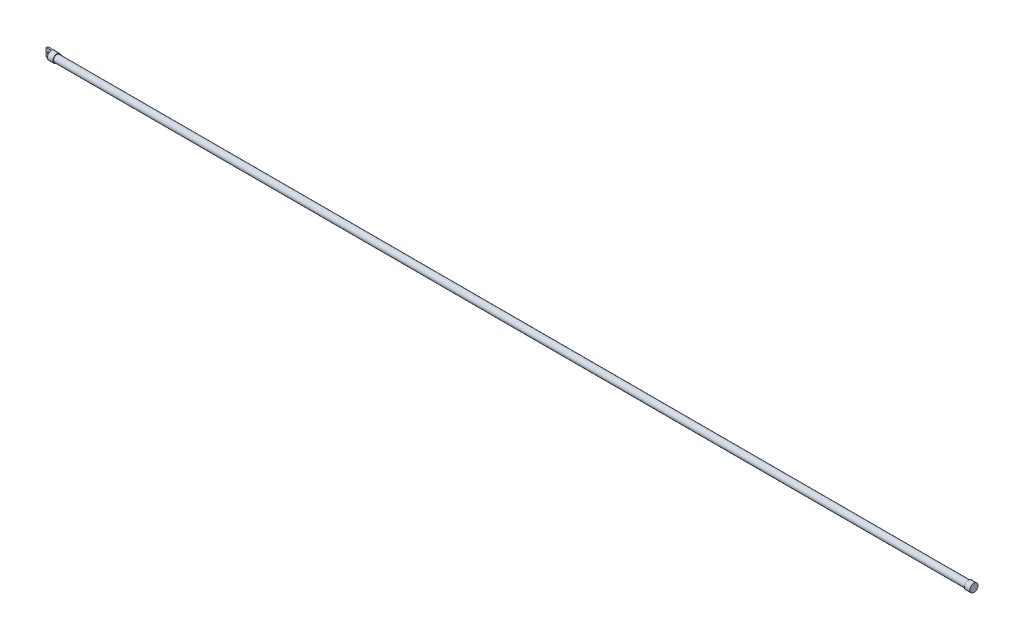
ISO-10303-21;
HEADER;
FILE_DESCRIPTION(('STEP AP214'),'2;1');
FILE_NAME('part.step','',(''),(''),'','','');
FILE_SCHEMA(('AUTOMOTIVE_DESIGN { 1 0 10303 214 1 1 1 1 }'));
ENDSEC;
DATA;
#1=APPLICATION_CONTEXT('core data for automotive mechanical design processes');
#2=APPLICATION_PROTOCOL_DEFINITION('international standard','automotive_design',2000,#1);
#3=PRODUCT_CONTEXT('',#1,'mechanical');
#4=PRODUCT('Part','Part','',(#3));
#5=PRODUCT_RELATED_PRODUCT_CATEGORY('part','',(#4));
#6=PRODUCT_DEFINITION_FORMATION('','',#4);
#7=PRODUCT_DEFINITION_CONTEXT('part definition',#1,'design');
#8=PRODUCT_DEFINITION('design','',#6,#7);
#9=PRODUCT_DEFINITION_SHAPE('','',#8);
#10=(LENGTH_UNIT() NAMED_UNIT(*) SI_UNIT(.MILLI.,.METRE.));
#11=(NAMED_UNIT(*) PLANE_ANGLE_UNIT() SI_UNIT($,.RADIAN.));
#12=(NAMED_UNIT(*) SI_UNIT($,.STERADIAN.) SOLID_ANGLE_UNIT());
#13=UNCERTAINTY_MEASURE_WITH_UNIT(LENGTH_MEASURE(1.E-05),#10,'distance_accuracy_value','');
#14=(GEOMETRIC_REPRESENTATION_CONTEXT(3) GLOBAL_UNCERTAINTY_ASSIGNED_CONTEXT((#13)) GLOBAL_UNIT_ASSIGNED_CONTEXT((#10,
#11,#12)) REPRESENTATION_CONTEXT('',''));
#15=CARTESIAN_POINT('',(0.,0.,0.));
#16=DIRECTION('',(0.,0.,1.));
#17=DIRECTION('',(1.,0.,0.));
#18=AXIS2_PLACEMENT_3D('',#15,#16,#17);
#19=CARTESIAN_POINT('',(4267.2,0.,0.));
#20=DIRECTION('',(-1.,0.,0.));
#21=DIRECTION('',(0.,0.,1.));
#22=AXIS2_PLACEMENT_3D('',#19,#20,#21);
#23=CYLINDRICAL_SURFACE('',#22,15.875);
#24=CARTESIAN_POINT('',(0.,0.,0.));
#25=DIRECTION('',(-1.,0.,0.));
#26=DIRECTION('',(0.,0.,1.));
#27=AXIS2_PLACEMENT_3D('',#24,#25,#26);
#28=CIRCLE('',#27,15.875);
#29=CARTESIAN_POINT('',(0.,0.,15.875));
#30=VERTEX_POINT('',#29);
#31=EDGE_CURVE('E69',#30,#30,#28,.T.);
#32=ORIENTED_EDGE('',*,*,#31,.F.);
#33=EDGE_LOOP('',(#32));
#34=FACE_BOUND('',#33,.T.);
#35=CARTESIAN_POINT('',(4241.8,0.,0.));
#36=DIRECTION('',(1.,0.,0.));
#37=DIRECTION('',(0.,0.,-1.));
#38=AXIS2_PLACEMENT_3D('',#35,#36,#37);
#39=CIRCLE('',#38,15.875);
#40=CARTESIAN_POINT('',(4241.8,0.,-15.875));
#41=VERTEX_POINT('',#40);
#42=EDGE_CURVE('E60',#41,#41,#39,.T.);
#43=ORIENTED_EDGE('',*,*,#42,.F.);
#44=EDGE_LOOP('',(#43));
#45=FACE_BOUND('',#44,.T.);
#46=ADVANCED_FACE('F32',(#34,#45),#23,.T.);
#47=CARTESIAN_POINT('',(4241.8,0.,0.));
#48=DIRECTION('',(1.,0.,0.));
#49=DIRECTION('',(0.,0.,-1.));
#50=AXIS2_PLACEMENT_3D('',#47,#48,#49);
#51=PLANE('',#50);
#52=CARTESIAN_POINT('',(4241.8,0.,0.));
#53=DIRECTION('',(1.,0.,0.));
#54=DIRECTION('',(0.,0.,-1.));
#55=AXIS2_PLACEMENT_3D('',#52,#53,#54);
#56=CIRCLE('',#55,19.05);
#57=CARTESIAN_POINT('',(4241.8,0.,-19.05));
#58=VERTEX_POINT('',#57);
#59=EDGE_CURVE('E79',#58,#58,#56,.T.);
#60=ORIENTED_EDGE('',*,*,#59,.F.);
#61=EDGE_LOOP('',(#60));
#62=FACE_BOUND('',#61,.T.);
#63=ORIENTED_EDGE('',*,*,#42,.T.);
#64=EDGE_LOOP('',(#63));
#65=FACE_BOUND('',#64,.T.);
#66=ADVANCED_FACE('F87',(#62,#65),#51,.F.);
#67=CARTESIAN_POINT('',(4241.8,0.,0.));
#68=DIRECTION('',(1.,0.,0.));
#69=DIRECTION('',(0.,0.,-1.));
#70=AXIS2_PLACEMENT_3D('',#67,#68,#69);
#71=CYLINDRICAL_SURFACE('',#70,19.05);
#72=ORIENTED_EDGE('',*,*,#59,.T.);
#73=EDGE_LOOP('',(#72));
#74=FACE_BOUND('',#73,.T.);
#75=CARTESIAN_POINT('',(4267.2,0.,0.));
#76=DIRECTION('',(1.,0.,0.));
#77=DIRECTION('',(0.,0.,-1.));
#78=AXIS2_PLACEMENT_3D('',#75,#76,#77);
#79=CIRCLE('',#78,19.05);
#80=CARTESIAN_POINT('',(4267.2,0.,-19.05));
#81=VERTEX_POINT('',#80);
#82=EDGE_CURVE('E73',#81,#81,#79,.T.);
#83=ORIENTED_EDGE('',*,*,#82,.F.);
#84=EDGE_LOOP('',(#83));
#85=FACE_BOUND('',#84,.T.);
#86=ADVANCED_FACE('F94',(#74,#85),#71,.T.);
#87=CARTESIAN_POINT('',(4267.2,0.,0.));
#88=DIRECTION('',(1.,0.,0.));
#89=DIRECTION('',(0.,0.,-1.));
#90=AXIS2_PLACEMENT_3D('',#87,#88,#89);
#91=PLANE('',#90);
#92=ORIENTED_EDGE('',*,*,#82,.T.);
#93=EDGE_LOOP('',(#92));
#94=FACE_BOUND('',#93,.T.);
#95=ADVANCED_FACE('F101',(#94),#91,.T.);
#96=CARTESIAN_POINT('',(0.,0.,0.));
#97=DIRECTION('',(-1.,0.,0.));
#98=DIRECTION('',(0.,0.,1.));
#99=AXIS2_PLACEMENT_3D('',#96,#97,#98);
#100=PLANE('',#99);
#101=CARTESIAN_POINT('',(0.,0.,0.));
#102=DIRECTION('',(-1.,0.,0.));
#103=DIRECTION('',(0.,0.,1.));
#104=AXIS2_PLACEMENT_3D('',#101,#102,#103);
#105=CIRCLE('',#104,19.05);
#106=CARTESIAN_POINT('',(0.,0.,19.05));
#107=VERTEX_POINT('',#106);
#108=EDGE_CURVE('E70',#107,#107,#105,.T.);
#109=ORIENTED_EDGE('',*,*,#108,.F.);
#110=EDGE_LOOP('',(#109));
#111=FACE_BOUND('',#110,.T.);
#112=ORIENTED_EDGE('',*,*,#31,.T.);
#113=EDGE_LOOP('',(#112));
#114=FACE_BOUND('',#113,.T.);
#115=ADVANCED_FACE('F99',(#111,#114),#100,.F.);
#116=CARTESIAN_POINT('',(-50.8,0.,0.));
#117=DIRECTION('',(1.,0.,0.));
#118=DIRECTION('',(0.,0.,-1.));
#119=AXIS2_PLACEMENT_3D('',#116,#117,#118);
#120=CYLINDRICAL_SURFACE('',#119,19.05);
#121=CARTESIAN_POINT('',(-31.75,0.,-19.05));
#122=CARTESIAN_POINT('',(-31.7499999276378,0.173206979816121,-19.0500000475544));
#123=CARTESIAN_POINT('',(-31.7570924399296,0.346412900541876,-19.0476323411038));
#124=CARTESIAN_POINT('',(-31.7853988596846,0.691601311110433,-19.0382249618458));
#125=CARTESIAN_POINT('',(-31.8066178799022,0.863583335207509,-19.0311835975216));
#126=CARTESIAN_POINT('',(-31.8629724237648,1.20495064928589,-19.0126222999959));
#127=CARTESIAN_POINT('',(-31.898103808817,1.3743366959572,-19.0011036986832));
#128=CARTESIAN_POINT('',(-31.9819775593791,1.70942803420247,-18.9738932742665));
#129=CARTESIAN_POINT('',(-32.0307251826636,1.87513187719384,-18.9581998392036));
#130=CARTESIAN_POINT('',(-32.1412853073881,2.20132105058004,-18.9230954347253));
#131=CARTESIAN_POINT('',(-32.2030702890873,2.36181656426823,-18.9036923038523));
#132=CARTESIAN_POINT('',(-32.3392884277158,2.67697294486436,-18.861643657703));
#133=CARTESIAN_POINT('',(-32.4137262645729,2.8316316269366,-18.8389969432077));
#134=CARTESIAN_POINT('',(-32.5746540459558,3.13406899750511,-18.7910497757426));
#135=CARTESIAN_POINT('',(-32.6611414823733,3.28184910924858,-18.7657498753001));
#136=CARTESIAN_POINT('',(-32.8456056484711,3.56974509074054,-18.7131195970424));
#137=CARTESIAN_POINT('',(-32.9435865005668,3.70985818392422,-18.6857884919782));
#138=CARTESIAN_POINT('',(-33.1535880112745,3.98578637726499,-18.6289146881802));
#139=CARTESIAN_POINT('',(-33.2659501290115,4.12133296305893,-18.5993296703084));
#140=CARTESIAN_POINT('',(-33.501456566368,4.38255929576647,-18.5395154443744));
#141=CARTESIAN_POINT('',(-33.6246011255233,4.50823882336203,-18.5092862220122));
#142=CARTESIAN_POINT('',(-33.8809614747341,4.74901553774605,-18.4489772883087));
#143=CARTESIAN_POINT('',(-34.0141811127906,4.86410864366074,-18.4188976388164));
#144=CARTESIAN_POINT('',(-34.289801826601,5.08289666356067,-18.3597250300466));
#145=CARTESIAN_POINT('',(-34.4321997394184,5.18659547118079,-18.3306317360784));
#146=CARTESIAN_POINT('',(-34.7296564433137,5.38480736636177,-18.2734042587362));
#147=CARTESIAN_POINT('',(-34.8849636102427,5.47896348886477,-18.2453229440573));
#148=CARTESIAN_POINT('',(-35.2033789289295,5.65376497667275,-18.1919156575976));
#149=CARTESIAN_POINT('',(-35.3664839701791,5.73441567232334,-18.1665886001519));
#150=CARTESIAN_POINT('',(-35.6994807069751,5.88159402568306,-18.1194737199416));
#151=CARTESIAN_POINT('',(-35.8693735998872,5.94811917848413,-18.0976865250677));
#152=CARTESIAN_POINT('',(-36.2146276910965,6.06639515366292,-18.0583841320978));
#153=CARTESIAN_POINT('',(-36.3899863573345,6.11815270763609,-18.0408669880933));
#154=CARTESIAN_POINT('',(-36.7389979304016,6.20495158956039,-18.0111940183235));
#155=CARTESIAN_POINT('',(-36.9125131587002,6.24049221012225,-17.9988790739554));
#156=CARTESIAN_POINT('',(-37.2621130255256,6.29696610143421,-17.9791995169245));
#157=CARTESIAN_POINT('',(-37.4381965614469,6.31790546258156,-17.9718328403146));
#158=CARTESIAN_POINT('',(-37.7916266406054,6.34498350403309,-17.9622908169983));
#159=CARTESIAN_POINT('',(-37.9689730959295,6.35112320464729,-17.960115112419));
#160=CARTESIAN_POINT('',(-38.3235414467177,6.3485398247218,-17.9610285072459));
#161=CARTESIAN_POINT('',(-38.5007633455553,6.33981716356741,-17.9641174580944));
#162=CARTESIAN_POINT('',(-38.8455739071675,6.30834384063319,-17.9751928357032));
#163=CARTESIAN_POINT('',(-39.0132310497841,6.2862561392762,-17.9829477165395));
#164=CARTESIAN_POINT('',(-39.3460488561246,6.22883516245981,-18.0029174212393));
#165=CARTESIAN_POINT('',(-39.5112086602302,6.19349742948017,-18.0151337459671));
#166=CARTESIAN_POINT('',(-39.8378100844255,6.10990376478512,-18.0436560154073));
#167=CARTESIAN_POINT('',(-39.999252732489,6.06165145233205,-18.0599608142595));
#168=CARTESIAN_POINT('',(-40.3174910779539,5.95260759283797,-18.0961946727035));
#169=CARTESIAN_POINT('',(-40.4742849849099,5.89181128446951,-18.1161251081381));
#170=CARTESIAN_POINT('',(-40.7846294633379,5.75711105118028,-18.1593846683067));
#171=CARTESIAN_POINT('',(-40.938090326431,5.68301613062838,-18.182762287283));
#172=CARTESIAN_POINT('',(-41.2383034780893,5.52290717349518,-18.2320325481052));
#173=CARTESIAN_POINT('',(-41.3850534516872,5.43688906456495,-18.2579260483393));
#174=CARTESIAN_POINT('',(-41.6709619221975,5.25352969212448,-18.3115276913353));
#175=CARTESIAN_POINT('',(-41.8101198982885,5.15618765320853,-18.3392359583063));
#176=CARTESIAN_POINT('',(-42.0800614588839,4.95079561055338,-18.3957458615903));
#177=CARTESIAN_POINT('',(-42.210844746996,4.84274522817477,-18.4245475365431));
#178=CARTESIAN_POINT('',(-42.4699319136144,4.61064072542746,-18.4840358963059));
#179=CARTESIAN_POINT('',(-42.5977461912074,4.48604452199054,-18.5147422324821));
#180=CARTESIAN_POINT('',(-42.8424464337536,4.22652342644298,-18.575703434143));
#181=CARTESIAN_POINT('',(-42.9593358297475,4.09160180148376,-18.6059584388461));
#182=CARTESIAN_POINT('',(-43.1815188690624,3.81215729550636,-18.6652179866419));
#183=CARTESIAN_POINT('',(-43.2868069689114,3.66762987695637,-18.6942219279428));
#184=CARTESIAN_POINT('',(-43.4849442138419,3.36998882083473,-18.7501624717454));
#185=CARTESIAN_POINT('',(-43.5777982793778,3.21687861391426,-18.777099890208));
#186=CARTESIAN_POINT('',(-43.751311532146,2.90136608662605,-18.8284460358764));
#187=CARTESIAN_POINT('',(-43.8318341058571,2.73888379955612,-18.852825607187));
#188=CARTESIAN_POINT('',(-43.9788113974916,2.40727117302262,-18.8980298666498));
#189=CARTESIAN_POINT('',(-44.0452715681074,2.23814344060155,-18.9188559320642));
#190=CARTESIAN_POINT('',(-44.163558777101,1.89440949234185,-18.9563603220822));
#191=CARTESIAN_POINT('',(-44.2153870061177,1.71980372355069,-18.9730389841577));
#192=CARTESIAN_POINT('',(-44.3039144398891,1.36642567213485,-19.0017577647123));
#193=CARTESIAN_POINT('',(-44.3406143409563,1.18765358167399,-19.0137980966785));
#194=CARTESIAN_POINT('',(-44.3972579625842,0.835171292256401,-19.0324663756725));
#195=CARTESIAN_POINT('',(-44.4178592890451,0.661577761094121,-19.0393063851572));
#196=CARTESIAN_POINT('',(-44.4446791680636,0.313163139048648,-19.0482228098157));
#197=CARTESIAN_POINT('',(-44.4508981701628,0.138342086704824,-19.0502993738781));
#198=CARTESIAN_POINT('',(-44.4488929516177,-0.211180699577593,-19.0496310005562));
#199=CARTESIAN_POINT('',(-44.4406708901043,-0.385882447447029,-19.0468867839424));
#200=CARTESIAN_POINT('',(-44.4098684948127,-0.733873450364134,-19.0366548939182));
#201=CARTESIAN_POINT('',(-44.3872883060322,-0.907162719658031,-19.0291672684097));
#202=CARTESIAN_POINT('',(-44.3288551400234,-1.24601609779628,-19.0099421572362));
#203=CARTESIAN_POINT('',(-44.2934089964992,-1.41165802541743,-18.9983351567187));
#204=CARTESIAN_POINT('',(-44.2094878330244,-1.73933064567692,-18.9711429855808));
#205=CARTESIAN_POINT('',(-44.1610084764415,-1.90136011684896,-18.9555564909225));
#206=CARTESIAN_POINT('',(-44.0514444025778,-2.22065102237401,-18.9208084901865));
#207=CARTESIAN_POINT('',(-43.9903630676732,-2.37791372316702,-18.901647943518));
#208=CARTESIAN_POINT('',(-43.8560394008498,-2.68679846475975,-18.8602202631813));
#209=CARTESIAN_POINT('',(-43.7827924703357,-2.83841834594381,-18.8379519552898));
#210=CARTESIAN_POINT('',(-43.6226340287902,-3.13890847872106,-18.7902499584476));
#211=CARTESIAN_POINT('',(-43.5354173898331,-3.28760543041955,-18.7647491525867));
#212=CARTESIAN_POINT('',(-43.3493492766861,-3.57721512709606,-18.7116999684213));
#213=CARTESIAN_POINT('',(-43.2504937905531,-3.71812516316432,-18.6841508852828));
#214=CARTESIAN_POINT('',(-43.0418134240538,-3.99130640387261,-18.6277060092511));
#215=CARTESIAN_POINT('',(-42.9319874864589,-4.12357677386765,-18.5988100867056));
#216=CARTESIAN_POINT('',(-42.7020524492227,-4.37871059436876,-18.54040247239));
#217=CARTESIAN_POINT('',(-42.5819430804423,-4.50157379850997,-18.5108907645187));
#218=CARTESIAN_POINT('',(-42.3264380874391,-4.74256806278791,-18.4506550930792));
#219=CARTESIAN_POINT('',(-42.190594822557,-4.86022661336041,-18.4199373319635));
#220=CARTESIAN_POINT('',(-41.90933472828,-5.08367167126115,-18.3595255094858));
#221=CARTESIAN_POINT('',(-41.763921090819,-5.18946210535388,-18.3298311117932));
#222=CARTESIAN_POINT('',(-41.4643206319029,-5.388525335144,-18.2723024560637));
#223=CARTESIAN_POINT('',(-41.3101301614477,-5.48179286946921,-18.2444689823258));
#224=CARTESIAN_POINT('',(-40.9940807074354,-5.65502039443443,-18.1915213339223));
#225=CARTESIAN_POINT('',(-40.8322249540841,-5.73498592764397,-18.1664060282044));
#226=CARTESIAN_POINT('',(-40.5021210996305,-5.88088643247245,-18.119700256613));
#227=CARTESIAN_POINT('',(-40.3338834294161,-5.94684322686595,-18.0981043206734));
#228=CARTESIAN_POINT('',(-39.9920265973133,-6.0642710619397,-18.0590959794666));
#229=CARTESIAN_POINT('',(-39.8184096779651,-6.11574805121028,-18.0416818566593));
#230=CARTESIAN_POINT('',(-39.46704911889,-6.20374641951342,-18.0116128053345));
#231=CARTESIAN_POINT('',(-39.2893061866693,-6.24027034288944,-17.9989570671825));
#232=CARTESIAN_POINT('',(-38.9310610986803,-6.29799572673677,-17.9788400300668));
#233=CARTESIAN_POINT('',(-38.7505590824325,-6.31919795939107,-17.9713784693274));
#234=CARTESIAN_POINT('',(-38.397614645785,-6.34536101450615,-17.9621566611392));
#235=CARTESIAN_POINT('',(-38.2252368738401,-6.35110334330266,-17.9601221272408));
#236=CARTESIAN_POINT('',(-37.8805373563697,-6.3485471048946,-17.9610259404646));
#237=CARTESIAN_POINT('',(-37.708215649795,-6.34024376515534,-17.9639659778814));
#238=CARTESIAN_POINT('',(-37.365047727789,-6.30967578351913,-17.9747253646517));
#239=CARTESIAN_POINT('',(-37.1942009013229,-6.28741723537024,-17.9825425843042));
#240=CARTESIAN_POINT('',(-36.8550840430731,-6.22914877747747,-18.0028096475755));
#241=CARTESIAN_POINT('',(-36.6868150038626,-6.19313370267922,-18.0152612311773));
#242=CARTESIAN_POINT('',(-36.3573348238322,-6.10851743523393,-18.0441256220386));
#243=CARTESIAN_POINT('',(-36.196050075909,-6.0601743306519,-18.0604567799901));
#244=CARTESIAN_POINT('',(-35.8781330472556,-5.95097195531921,-18.0967328909403));
#245=CARTESIAN_POINT('',(-35.721502439718,-5.89010824417334,-18.1166791257158));
#246=CARTESIAN_POINT('',(-35.4139337064025,-5.75635872960047,-18.1596190192289));
#247=CARTESIAN_POINT('',(-35.2629945595996,-5.68347509522737,-18.1826121279965));
#248=CARTESIAN_POINT('',(-34.9675970183144,-5.52617088916445,-18.2310369188305));
#249=CARTESIAN_POINT('',(-34.82314097777,-5.44174617134765,-18.2564694762833));
#250=CARTESIAN_POINT('',(-34.5354400230923,-5.25802199045283,-18.3102500594207));
#251=CARTESIAN_POINT('',(-34.3925206937621,-5.15823547260395,-18.3386767604253));
#252=CARTESIAN_POINT('',(-34.1155057850173,-4.94738392202038,-18.3966802768163));
#253=CARTESIAN_POINT('',(-33.9814105107874,-4.83631849953624,-18.4262571319251));
#254=CARTESIAN_POINT('',(-33.7227759198538,-4.60355182793463,-18.4857849167109));
#255=CARTESIAN_POINT('',(-33.5982406687801,-4.48184610031711,-18.51573599931));
#256=CARTESIAN_POINT('',(-33.3595749666718,-4.22860900687018,-18.5752059114817));
#257=CARTESIAN_POINT('',(-33.2454411249686,-4.09708086858838,-18.6047248792629));
#258=CARTESIAN_POINT('',(-33.02395876714,-3.81956162783048,-18.6637175514635));
#259=CARTESIAN_POINT('',(-32.9170552735884,-3.67320473285502,-18.693143572695));
#260=CARTESIAN_POINT('',(-32.7160197516758,-3.371658401601,-18.7498785198637));
#261=CARTESIAN_POINT('',(-32.621882940103,-3.21647230441005,-18.7771882370501));
#262=CARTESIAN_POINT('',(-32.447045726598,-2.89820274632956,-18.8289382459717));
#263=CARTESIAN_POINT('',(-32.3663480580944,-2.73511768753172,-18.8533779536693));
#264=CARTESIAN_POINT('',(-32.2191253551788,-2.40227193910479,-18.8986713660276));
#265=CARTESIAN_POINT('',(-32.1525939701866,-2.23251428132623,-18.9195266767198));
#266=CARTESIAN_POINT('',(-32.0368873180788,-1.8951370385337,-18.9562248471232));
#267=CARTESIAN_POINT('',(-31.9870736850795,-1.72775594881919,-18.9722488458237));
#268=CARTESIAN_POINT('',(-31.9013603926188,-1.38918879693756,-19.0000391476739));
#269=CARTESIAN_POINT('',(-31.8654550633733,-1.218004315396,-19.0118071856555));
#270=CARTESIAN_POINT('',(-31.8078678223425,-0.873014688703107,-19.0307694822748));
#271=CARTESIAN_POINT('',(-31.7861852938081,-0.699209657522146,-19.0379639392381));
#272=CARTESIAN_POINT('',(-31.7572514390952,-0.350269387520865,-19.0475791674846));
#273=CARTESIAN_POINT('',(-31.7500000731674,-0.175134152365816,-19.0499999519165));
#274=CARTESIAN_POINT('',(-31.75,0.,-19.05));
#275=B_SPLINE_CURVE_WITH_KNOTS('',3,(#121,#122,#123,#124,#125,#126,#127,#128,#129,#130,#131,
#132,#133,#134,#135,#136,#137,#138,#139,#140,#141,#142,#143,#144,#145,#146,#147,#148,#149,#150,
#151,#152,#153,#154,#155,#156,#157,#158,#159,#160,#161,#162,#163,#164,#165,#166,#167,#168,#169,
#170,#171,#172,#173,#174,#175,#176,#177,#178,#179,#180,#181,#182,#183,#184,#185,#186,#187,#188,
#189,#190,#191,#192,#193,#194,#195,#196,#197,#198,#199,#200,#201,#202,#203,#204,#205,#206,#207,
#208,#209,#210,#211,#212,#213,#214,#215,#216,#217,#218,#219,#220,#221,#222,#223,#224,#225,#226,
#227,#228,#229,#230,#231,#232,#233,#234,#235,#236,#237,#238,#239,#240,#241,#242,#243,#244,#245,
#246,#247,#248,#249,#250,#251,#252,#253,#254,#255,#256,#257,#258,#259,#260,#261,#262,#263,#264,
#265,#266,#267,#268,#269,#270,#271,#272,#273,#274),.UNSPECIFIED.,.T.,.F.,(4,2,2,2,2,2,2,2,2,2,2,
2,2,2,2,2,2,2,2,2,2,2,2,2,2,2,2,2,2,2,2,2,2,2,2,2,2,2,2,2,2,2,2,2,2,2,2,2,2,2,2,2,2,2,2,2,2,2,2,
2,2,2,2,2,2,2,2,2,2,2,2,2,2,2,2,2,4),(0.,0.519458569393286,1.03910524677538,1.55859745778493,
2.07829054350248,2.59689742324836,3.11569653985648,3.63438783000186,4.15326573456098,
4.68825393169906,5.2232540168139,5.75845947797002,6.29348147733769,6.84413750048861,
7.39457567487732,7.94511137809326,8.49539572520658,9.027354122279,9.55909049884023,
10.0907902156778,10.6224749292908,11.1297302811145,11.637156434996,12.1444405332349,
12.6519175368141,13.1673706187555,13.6830001888055,14.1986650873782,14.7143482260051,
15.2570716454942,15.7996240418451,16.3424345730851,16.885029661983,17.4332578936979,
17.981273158951,18.529243817924,19.0771892525985,19.6013734715542,20.1255413061125,
20.64963077729,21.1737149559553,21.6824953195602,22.1914451831988,22.7002586217752,
23.2092648314004,23.7314723590618,24.2538604230661,24.7762988785647,25.2987510115601,
25.8450678149494,26.3912033238479,26.9375675729378,27.4837035940661,28.0289825026794,
28.5740370716692,29.1189988581493,29.6639331777145,30.1807526946974,30.697747855478,
31.2145174197616,31.7314812024583,32.2384024781404,32.7455038428125,33.2525137984933,
33.7597063782056,34.2889454073646,34.8182027309295,35.3476839011333,35.876991848137,
36.4271714288383,36.9771443043958,37.5272289043733,38.0770663862097,38.6025433311706,
39.1278058370275,39.6530455642045,40.1782838446505),.UNSPECIFIED.);
#276=CARTESIAN_POINT('',(-31.75,0.,-19.05));
#277=VERTEX_POINT('',#276);
#278=EDGE_CURVE('E117',#277,#277,#275,.T.);
#279=ORIENTED_EDGE('',*,*,#278,.T.);
#280=EDGE_LOOP('',(#279));
#281=FACE_BOUND('',#280,.T.);
#282=CARTESIAN_POINT('',(-50.8,0.,0.));
#283=DIRECTION('',(-1.,0.,0.));
#284=DIRECTION('',(0.,0.,1.));
#285=AXIS2_PLACEMENT_3D('',#282,#283,#284);
#286=CIRCLE('',#285,19.05);
#287=CARTESIAN_POINT('',(-50.8,19.05,0.));
#288=VERTEX_POINT('',#287);
#289=CARTESIAN_POINT('',(-50.8,-19.05,0.));
#290=VERTEX_POINT('',#289);
#291=EDGE_CURVE('E65',#288,#290,#286,.T.);
#292=ORIENTED_EDGE('',*,*,#291,.F.);
#293=DIRECTION('',(1.,0.,0.));
#294=VECTOR('',#293,1.);
#295=CARTESIAN_POINT('',(-50.8,19.05,0.));
#296=LINE('',#295,#294);
#297=CARTESIAN_POINT('',(-25.4,19.05,0.));
#298=VERTEX_POINT('',#297);
#299=EDGE_CURVE('E46',#288,#298,#296,.T.);
#300=ORIENTED_EDGE('',*,*,#299,.T.);
#301=CARTESIAN_POINT('',(-25.4,0.,0.));
#302=DIRECTION('',(-1.,0.,0.));
#303=DIRECTION('',(0.,0.,1.));
#304=AXIS2_PLACEMENT_3D('',#301,#302,#303);
#305=CIRCLE('',#304,19.05);
#306=CARTESIAN_POINT('',(-25.4,-19.05,0.));
#307=VERTEX_POINT('',#306);
#308=EDGE_CURVE('E11',#307,#298,#305,.T.);
#309=ORIENTED_EDGE('',*,*,#308,.F.);
#310=DIRECTION('',(1.,0.,0.));
#311=VECTOR('',#310,1.);
#312=CARTESIAN_POINT('',(-50.8,-19.05,0.));
#313=LINE('',#312,#311);
#314=EDGE_CURVE('E51',#307,#290,#313,.F.);
#315=ORIENTED_EDGE('',*,*,#314,.T.);
#316=EDGE_LOOP('',(#292,#300,#309,#315));
#317=FACE_BOUND('',#316,.T.);
#318=ORIENTED_EDGE('',*,*,#108,.T.);
#319=EDGE_LOOP('',(#318));
#320=FACE_BOUND('',#319,.T.);
#321=ADVANCED_FACE('F63',(#281,#317,#320),#120,.T.);
#322=CARTESIAN_POINT('',(-50.8,0.,0.));
#323=DIRECTION('',(-1.,0.,0.));
#324=DIRECTION('',(0.,0.,1.));
#325=AXIS2_PLACEMENT_3D('',#322,#323,#324);
#326=PLANE('',#325);
#327=DIRECTION('',(0.,-1.,0.));
#328=VECTOR('',#327,1.);
#329=CARTESIAN_POINT('',(-50.8,0.,0.));
#330=LINE('',#329,#328);
#331=EDGE_CURVE('E39',#288,#290,#330,.T.);
#332=ORIENTED_EDGE('',*,*,#331,.F.);
#333=ORIENTED_EDGE('',*,*,#291,.T.);
#334=EDGE_LOOP('',(#332,#333));
#335=FACE_BOUND('',#334,.T.);
#336=ADVANCED_FACE('F68',(#335),#326,.T.);
#337=CARTESIAN_POINT('',(-25.4,-24.1082968588557,0.));
#338=DIRECTION('',(-1.,0.,0.));
#339=DIRECTION('',(0.,0.,1.));
#340=AXIS2_PLACEMENT_3D('',#337,#338,#339);
#341=PLANE('',#340);
#342=ORIENTED_EDGE('',*,*,#308,.T.);
#343=DIRECTION('',(0.,-1.,0.));
#344=VECTOR('',#343,1.);
#345=CARTESIAN_POINT('',(-25.4,26.527876831949,0.));
#346=LINE('',#345,#344);
#347=EDGE_CURVE('E66',#298,#307,#346,.T.);
#348=ORIENTED_EDGE('',*,*,#347,.T.);
#349=EDGE_LOOP('',(#342,#348));
#350=FACE_BOUND('',#349,.T.);
#351=ADVANCED_FACE('F130',(#350),#341,.T.);
#352=CARTESIAN_POINT('',(-25.4,26.527876831949,0.));
#353=DIRECTION('',(0.,0.,-1.));
#354=DIRECTION('',(-1.,0.,0.));
#355=AXIS2_PLACEMENT_3D('',#352,#353,#354);
#356=PLANE('',#355);
#357=CARTESIAN_POINT('',(-38.1,0.,0.));
#358=DIRECTION('',(0.,0.,1.));
#359=DIRECTION('',(1.,0.,0.));
#360=AXIS2_PLACEMENT_3D('',#357,#358,#359);
#361=CIRCLE('',#360,6.35);
#362=CARTESIAN_POINT('',(-31.75,0.,0.));
#363=VERTEX_POINT('',#362);
#364=EDGE_CURVE('E124',#363,#363,#361,.T.);
#365=ORIENTED_EDGE('',*,*,#364,.F.);
#366=EDGE_LOOP('',(#365));
#367=FACE_BOUND('',#366,.T.);
#368=ORIENTED_EDGE('',*,*,#331,.T.);
#369=ORIENTED_EDGE('',*,*,#314,.F.);
#370=ORIENTED_EDGE('',*,*,#347,.F.);
#371=ORIENTED_EDGE('',*,*,#299,.F.);
#372=EDGE_LOOP('',(#368,#369,#370,#371));
#373=FACE_BOUND('',#372,.T.);
#374=ADVANCED_FACE('F56',(#367,#373),#356,.F.);
#375=CARTESIAN_POINT('',(-38.1,0.,-19.05));
#376=DIRECTION('',(0.,0.,1.));
#377=DIRECTION('',(1.,0.,0.));
#378=AXIS2_PLACEMENT_3D('',#375,#376,#377);
#379=CYLINDRICAL_SURFACE('',#378,6.35);
#380=ORIENTED_EDGE('',*,*,#364,.T.);
#381=EDGE_LOOP('',(#380));
#382=FACE_BOUND('',#381,.T.);
#383=ORIENTED_EDGE('',*,*,#278,.F.);
#384=EDGE_LOOP('',(#383));
#385=FACE_BOUND('',#384,.T.);
#386=ADVANCED_FACE('F125',(#382,#385),#379,.F.);
#387=CLOSED_SHELL('',(#46,#66,#86,#95,#115,#321,#336,#351,#374,#386));
#388=MANIFOLD_SOLID_BREP('B2',#387);
#389=ADVANCED_BREP_SHAPE_REPRESENTATION('',(#18,#388),#14);
#390=SHAPE_DEFINITION_REPRESENTATION(#9,#389);
ENDSEC;
END-ISO-10303-21;
